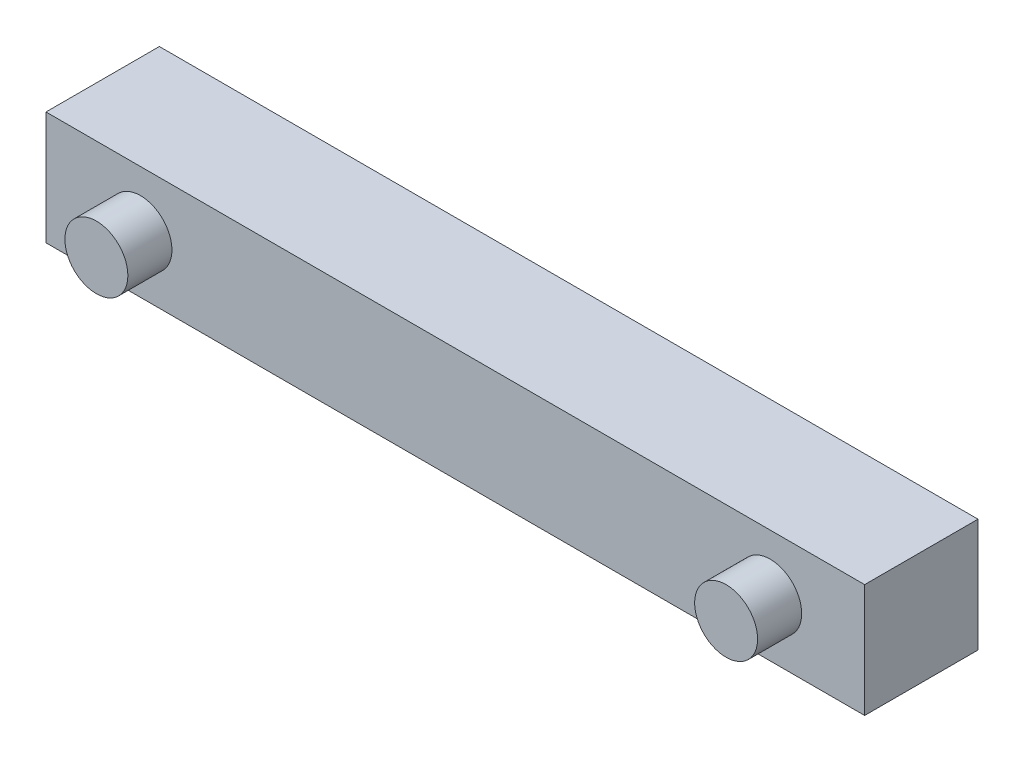
ISO-10303-21;
HEADER;
FILE_DESCRIPTION(('STEP AP214'),'2;1');
FILE_NAME('part.step','',(''),(''),'','','');
FILE_SCHEMA(('AUTOMOTIVE_DESIGN { 1 0 10303 214 1 1 1 1 }'));
ENDSEC;
DATA;
#1=APPLICATION_CONTEXT('core data for automotive mechanical design processes');
#2=APPLICATION_PROTOCOL_DEFINITION('international standard','automotive_design',2000,#1);
#3=PRODUCT_CONTEXT('',#1,'mechanical');
#4=PRODUCT('Part','Part','',(#3));
#5=PRODUCT_RELATED_PRODUCT_CATEGORY('part','',(#4));
#6=PRODUCT_DEFINITION_FORMATION('','',#4);
#7=PRODUCT_DEFINITION_CONTEXT('part definition',#1,'design');
#8=PRODUCT_DEFINITION('design','',#6,#7);
#9=PRODUCT_DEFINITION_SHAPE('','',#8);
#10=(LENGTH_UNIT() NAMED_UNIT(*) SI_UNIT(.MILLI.,.METRE.));
#11=(NAMED_UNIT(*) PLANE_ANGLE_UNIT() SI_UNIT($,.RADIAN.));
#12=(NAMED_UNIT(*) SI_UNIT($,.STERADIAN.) SOLID_ANGLE_UNIT());
#13=UNCERTAINTY_MEASURE_WITH_UNIT(LENGTH_MEASURE(1.E-05),#10,'distance_accuracy_value','');
#14=(GEOMETRIC_REPRESENTATION_CONTEXT(3) GLOBAL_UNCERTAINTY_ASSIGNED_CONTEXT((#13)) GLOBAL_UNIT_ASSIGNED_CONTEXT((#10,
#11,#12)) REPRESENTATION_CONTEXT('',''));
#15=CARTESIAN_POINT('',(0.,0.,0.));
#16=DIRECTION('',(0.,0.,1.));
#17=DIRECTION('',(1.,0.,0.));
#18=AXIS2_PLACEMENT_3D('',#15,#16,#17);
#19=CARTESIAN_POINT('',(2.22044604925031E-13,228.6,228.6));
#20=DIRECTION('',(1.,0.,0.));
#21=DIRECTION('',(0.,1.,0.));
#22=AXIS2_PLACEMENT_3D('',#19,#20,#21);
#23=PLANE('',#22);
#24=DIRECTION('',(0.,-1.,0.));
#25=VECTOR('',#24,1.);
#26=CARTESIAN_POINT('',(2.22044604925031E-13,228.6,0.));
#27=LINE('',#26,#25);
#28=CARTESIAN_POINT('',(2.22044604925031E-13,228.6,0.));
#29=VERTEX_POINT('',#28);
#30=CARTESIAN_POINT('',(0.,0.,0.));
#31=VERTEX_POINT('',#30);
#32=EDGE_CURVE('E96',#29,#31,#27,.T.);
#33=ORIENTED_EDGE('',*,*,#32,.T.);
#34=DIRECTION('',(0.,0.,-1.));
#35=VECTOR('',#34,1.);
#36=CARTESIAN_POINT('',(0.,0.,228.6));
#37=LINE('',#36,#35);
#38=CARTESIAN_POINT('',(0.,0.,228.6));
#39=VERTEX_POINT('',#38);
#40=EDGE_CURVE('E11',#39,#31,#37,.T.);
#41=ORIENTED_EDGE('',*,*,#40,.F.);
#42=DIRECTION('',(0.,-1.,0.));
#43=VECTOR('',#42,1.);
#44=CARTESIAN_POINT('',(2.22044604925031E-13,228.6,228.6));
#45=LINE('',#44,#43);
#46=CARTESIAN_POINT('',(2.22044604925031E-13,228.6,228.6));
#47=VERTEX_POINT('',#46);
#48=EDGE_CURVE('E84',#47,#39,#45,.T.);
#49=ORIENTED_EDGE('',*,*,#48,.F.);
#50=DIRECTION('',(0.,0.,-1.));
#51=VECTOR('',#50,1.);
#52=CARTESIAN_POINT('',(2.22044604925031E-13,228.6,228.6));
#53=LINE('',#52,#51);
#54=EDGE_CURVE('E92',#47,#29,#53,.T.);
#55=ORIENTED_EDGE('',*,*,#54,.T.);
#56=EDGE_LOOP('',(#33,#41,#49,#55));
#57=FACE_BOUND('',#56,.T.);
#58=ADVANCED_FACE('F33',(#57),#23,.F.);
#59=CARTESIAN_POINT('',(0.,0.,228.6));
#60=DIRECTION('',(0.,1.,0.));
#61=DIRECTION('',(0.,0.,1.));
#62=AXIS2_PLACEMENT_3D('',#59,#60,#61);
#63=PLANE('',#62);
#64=DIRECTION('',(1.,0.,0.));
#65=VECTOR('',#64,1.);
#66=CARTESIAN_POINT('',(0.,0.,0.));
#67=LINE('',#66,#65);
#68=CARTESIAN_POINT('',(1651.,0.,0.));
#69=VERTEX_POINT('',#68);
#70=EDGE_CURVE('E88',#31,#69,#67,.T.);
#71=ORIENTED_EDGE('',*,*,#70,.T.);
#72=DIRECTION('',(0.,0.,-1.));
#73=VECTOR('',#72,1.);
#74=CARTESIAN_POINT('',(1651.,0.,228.6));
#75=LINE('',#74,#73);
#76=CARTESIAN_POINT('',(1651.,0.,228.6));
#77=VERTEX_POINT('',#76);
#78=EDGE_CURVE('E41',#77,#69,#75,.T.);
#79=ORIENTED_EDGE('',*,*,#78,.F.);
#80=DIRECTION('',(1.,0.,0.));
#81=VECTOR('',#80,1.);
#82=CARTESIAN_POINT('',(0.,0.,228.6));
#83=LINE('',#82,#81);
#84=EDGE_CURVE('E79',#39,#77,#83,.T.);
#85=ORIENTED_EDGE('',*,*,#84,.F.);
#86=ORIENTED_EDGE('',*,*,#40,.T.);
#87=EDGE_LOOP('',(#71,#79,#85,#86));
#88=FACE_BOUND('',#87,.T.);
#89=ADVANCED_FACE('F87',(#88),#63,.F.);
#90=CARTESIAN_POINT('',(1651.,0.,228.6));
#91=DIRECTION('',(-1.,0.,0.));
#92=DIRECTION('',(0.,0.,1.));
#93=AXIS2_PLACEMENT_3D('',#90,#91,#92);
#94=PLANE('',#93);
#95=DIRECTION('',(0.,1.,0.));
#96=VECTOR('',#95,1.);
#97=CARTESIAN_POINT('',(1651.,0.,0.));
#98=LINE('',#97,#96);
#99=CARTESIAN_POINT('',(1651.,228.6,0.));
#100=VERTEX_POINT('',#99);
#101=EDGE_CURVE('E66',#69,#100,#98,.T.);
#102=ORIENTED_EDGE('',*,*,#101,.T.);
#103=DIRECTION('',(0.,0.,-1.));
#104=VECTOR('',#103,1.);
#105=CARTESIAN_POINT('',(1651.,228.6,228.6));
#106=LINE('',#105,#104);
#107=CARTESIAN_POINT('',(1651.,228.6,228.6));
#108=VERTEX_POINT('',#107);
#109=EDGE_CURVE('E89',#108,#100,#106,.T.);
#110=ORIENTED_EDGE('',*,*,#109,.F.);
#111=DIRECTION('',(0.,1.,0.));
#112=VECTOR('',#111,1.);
#113=CARTESIAN_POINT('',(1651.,0.,228.6));
#114=LINE('',#113,#112);
#115=EDGE_CURVE('E82',#77,#108,#114,.T.);
#116=ORIENTED_EDGE('',*,*,#115,.F.);
#117=ORIENTED_EDGE('',*,*,#78,.T.);
#118=EDGE_LOOP('',(#102,#110,#116,#117));
#119=FACE_BOUND('',#118,.T.);
#120=ADVANCED_FACE('F90',(#119),#94,.F.);
#121=CARTESIAN_POINT('',(1651.,228.6,228.6));
#122=DIRECTION('',(0.,-1.,0.));
#123=DIRECTION('',(1.,0.,0.));
#124=AXIS2_PLACEMENT_3D('',#121,#122,#123);
#125=PLANE('',#124);
#126=DIRECTION('',(-1.,0.,0.));
#127=VECTOR('',#126,1.);
#128=CARTESIAN_POINT('',(1651.,228.6,0.));
#129=LINE('',#128,#127);
#130=EDGE_CURVE('E72',#100,#29,#129,.T.);
#131=ORIENTED_EDGE('',*,*,#130,.T.);
#132=ORIENTED_EDGE('',*,*,#54,.F.);
#133=DIRECTION('',(-1.,0.,0.));
#134=VECTOR('',#133,1.);
#135=CARTESIAN_POINT('',(1651.,228.6,228.6));
#136=LINE('',#135,#134);
#137=EDGE_CURVE('E49',#108,#47,#136,.T.);
#138=ORIENTED_EDGE('',*,*,#137,.F.);
#139=ORIENTED_EDGE('',*,*,#109,.T.);
#140=EDGE_LOOP('',(#131,#132,#138,#139));
#141=FACE_BOUND('',#140,.T.);
#142=ADVANCED_FACE('F104',(#141),#125,.F.);
#143=CARTESIAN_POINT('',(0.,0.,228.6));
#144=DIRECTION('',(0.,0.,1.));
#145=DIRECTION('',(1.,0.,0.));
#146=AXIS2_PLACEMENT_3D('',#143,#144,#145);
#147=PLANE('',#146);
#148=CARTESIAN_POINT('',(1460.5,114.3,228.6));
#149=DIRECTION('',(0.,0.,1.));
#150=DIRECTION('',(-1.,0.,0.));
#151=AXIS2_PLACEMENT_3D('',#148,#149,#150);
#152=CIRCLE('',#151,63.4999999999999);
#153=CARTESIAN_POINT('',(1397.,114.3,228.6));
#154=VERTEX_POINT('',#153);
#155=EDGE_CURVE('E116',#154,#154,#152,.T.);
#156=ORIENTED_EDGE('',*,*,#155,.F.);
#157=EDGE_LOOP('',(#156));
#158=FACE_BOUND('',#157,.T.);
#159=CARTESIAN_POINT('',(190.5,114.3,228.6));
#160=DIRECTION('',(0.,0.,1.));
#161=DIRECTION('',(1.,0.,0.));
#162=AXIS2_PLACEMENT_3D('',#159,#160,#161);
#163=CIRCLE('',#162,63.5);
#164=CARTESIAN_POINT('',(254.,114.3,228.6));
#165=VERTEX_POINT('',#164);
#166=EDGE_CURVE('E110',#165,#165,#163,.T.);
#167=ORIENTED_EDGE('',*,*,#166,.F.);
#168=EDGE_LOOP('',(#167));
#169=FACE_BOUND('',#168,.T.);
#170=ORIENTED_EDGE('',*,*,#48,.T.);
#171=ORIENTED_EDGE('',*,*,#84,.T.);
#172=ORIENTED_EDGE('',*,*,#115,.T.);
#173=ORIENTED_EDGE('',*,*,#137,.T.);
#174=EDGE_LOOP('',(#170,#171,#172,#173));
#175=FACE_BOUND('',#174,.T.);
#176=ADVANCED_FACE('F80',(#158,#169,#175),#147,.T.);
#177=CARTESIAN_POINT('',(0.,0.,0.));
#178=DIRECTION('',(0.,0.,1.));
#179=DIRECTION('',(1.,0.,0.));
#180=AXIS2_PLACEMENT_3D('',#177,#178,#179);
#181=PLANE('',#180);
#182=ORIENTED_EDGE('',*,*,#32,.F.);
#183=ORIENTED_EDGE('',*,*,#130,.F.);
#184=ORIENTED_EDGE('',*,*,#101,.F.);
#185=ORIENTED_EDGE('',*,*,#70,.F.);
#186=EDGE_LOOP('',(#182,#183,#184,#185));
#187=FACE_BOUND('',#186,.T.);
#188=ADVANCED_FACE('F107',(#187),#181,.F.);
#189=CARTESIAN_POINT('',(190.5,114.3,317.5));
#190=DIRECTION('',(0.,0.,-1.));
#191=DIRECTION('',(-1.,0.,0.));
#192=AXIS2_PLACEMENT_3D('',#189,#190,#191);
#193=CYLINDRICAL_SURFACE('',#192,63.5);
#194=CARTESIAN_POINT('',(190.5,114.3,317.5));
#195=DIRECTION('',(0.,0.,1.));
#196=DIRECTION('',(1.,0.,0.));
#197=AXIS2_PLACEMENT_3D('',#194,#195,#196);
#198=CIRCLE('',#197,63.5);
#199=CARTESIAN_POINT('',(254.,114.3,317.5));
#200=VERTEX_POINT('',#199);
#201=EDGE_CURVE('E99',#200,#200,#198,.T.);
#202=ORIENTED_EDGE('',*,*,#201,.F.);
#203=EDGE_LOOP('',(#202));
#204=FACE_BOUND('',#203,.T.);
#205=ORIENTED_EDGE('',*,*,#166,.T.);
#206=EDGE_LOOP('',(#205));
#207=FACE_BOUND('',#206,.T.);
#208=ADVANCED_FACE('F136',(#204,#207),#193,.T.);
#209=CARTESIAN_POINT('',(190.5,114.3,317.5));
#210=DIRECTION('',(0.,0.,1.));
#211=DIRECTION('',(1.,0.,0.));
#212=AXIS2_PLACEMENT_3D('',#209,#210,#211);
#213=PLANE('',#212);
#214=ORIENTED_EDGE('',*,*,#201,.T.);
#215=EDGE_LOOP('',(#214));
#216=FACE_BOUND('',#215,.T.);
#217=ADVANCED_FACE('F127',(#216),#213,.T.);
#218=CARTESIAN_POINT('',(1460.5,114.3,317.5));
#219=DIRECTION('',(0.,0.,-1.));
#220=DIRECTION('',(-1.,0.,0.));
#221=AXIS2_PLACEMENT_3D('',#218,#219,#220);
#222=CYLINDRICAL_SURFACE('',#221,63.4999999999999);
#223=CARTESIAN_POINT('',(1460.5,114.3,317.5));
#224=DIRECTION('',(0.,0.,1.));
#225=DIRECTION('',(-1.,0.,0.));
#226=AXIS2_PLACEMENT_3D('',#223,#224,#225);
#227=CIRCLE('',#226,63.4999999999999);
#228=CARTESIAN_POINT('',(1397.,114.3,317.5));
#229=VERTEX_POINT('',#228);
#230=EDGE_CURVE('E113',#229,#229,#227,.T.);
#231=ORIENTED_EDGE('',*,*,#230,.F.);
#232=EDGE_LOOP('',(#231));
#233=FACE_BOUND('',#232,.T.);
#234=ORIENTED_EDGE('',*,*,#155,.T.);
#235=EDGE_LOOP('',(#234));
#236=FACE_BOUND('',#235,.T.);
#237=ADVANCED_FACE('F124',(#233,#236),#222,.T.);
#238=CARTESIAN_POINT('',(1460.5,114.3,317.5));
#239=DIRECTION('',(0.,0.,-1.));
#240=DIRECTION('',(-1.,0.,0.));
#241=AXIS2_PLACEMENT_3D('',#238,#239,#240);
#242=PLANE('',#241);
#243=ORIENTED_EDGE('',*,*,#230,.T.);
#244=EDGE_LOOP('',(#243));
#245=FACE_BOUND('',#244,.T.);
#246=ADVANCED_FACE('F122',(#245),#242,.F.);
#247=CLOSED_SHELL('',(#58,#89,#120,#142,#176,#188,#208,#217,#237,#246));
#248=MANIFOLD_SOLID_BREP('B2',#247);
#249=ADVANCED_BREP_SHAPE_REPRESENTATION('',(#18,#248),#14);
#250=SHAPE_DEFINITION_REPRESENTATION(#9,#249);
ENDSEC;
END-ISO-10303-21;
